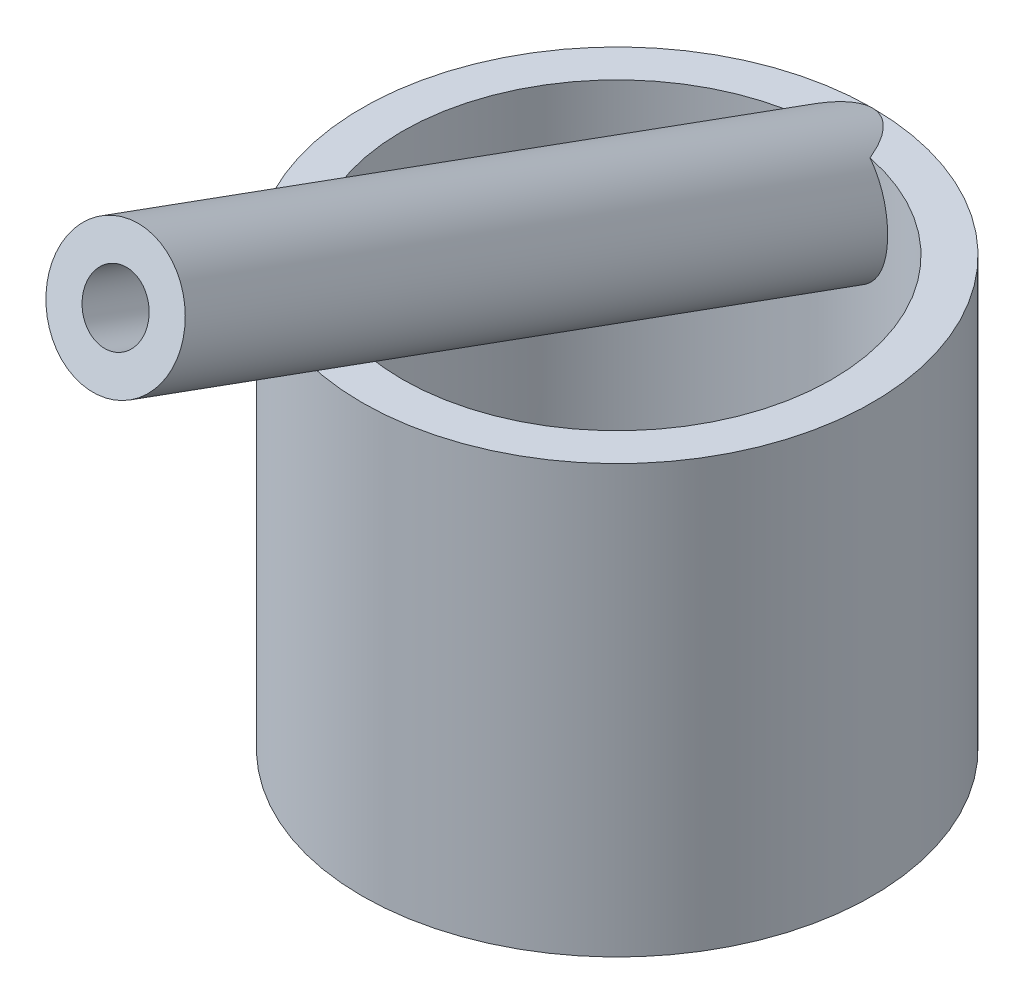
ISO-10303-21;
HEADER;
FILE_DESCRIPTION(('STEP AP214'),'2;1');
FILE_NAME('part.step','',(''),(''),'','','');
FILE_SCHEMA(('AUTOMOTIVE_DESIGN { 1 0 10303 214 1 1 1 1 }'));
ENDSEC;
DATA;
#1=APPLICATION_CONTEXT('core data for automotive mechanical design processes');
#2=APPLICATION_PROTOCOL_DEFINITION('international standard','automotive_design',2000,#1);
#3=PRODUCT_CONTEXT('',#1,'mechanical');
#4=PRODUCT('Part','Part','',(#3));
#5=PRODUCT_RELATED_PRODUCT_CATEGORY('part','',(#4));
#6=PRODUCT_DEFINITION_FORMATION('','',#4);
#7=PRODUCT_DEFINITION_CONTEXT('part definition',#1,'design');
#8=PRODUCT_DEFINITION('design','',#6,#7);
#9=PRODUCT_DEFINITION_SHAPE('','',#8);
#10=(LENGTH_UNIT() NAMED_UNIT(*) SI_UNIT(.MILLI.,.METRE.));
#11=(NAMED_UNIT(*) PLANE_ANGLE_UNIT() SI_UNIT($,.RADIAN.));
#12=(NAMED_UNIT(*) SI_UNIT($,.STERADIAN.) SOLID_ANGLE_UNIT());
#13=UNCERTAINTY_MEASURE_WITH_UNIT(LENGTH_MEASURE(1.E-05),#10,'distance_accuracy_value','');
#14=(GEOMETRIC_REPRESENTATION_CONTEXT(3) GLOBAL_UNCERTAINTY_ASSIGNED_CONTEXT((#13)) GLOBAL_UNIT_ASSIGNED_CONTEXT((#10,
#11,#12)) REPRESENTATION_CONTEXT('',''));
#15=CARTESIAN_POINT('',(0.,0.,0.));
#16=DIRECTION('',(0.,0.,1.));
#17=DIRECTION('',(1.,0.,0.));
#18=AXIS2_PLACEMENT_3D('',#15,#16,#17);
#19=CARTESIAN_POINT('',(0.,22.225,0.));
#20=DIRECTION('',(0.,1.,0.));
#21=DIRECTION('',(0.,0.,1.));
#22=AXIS2_PLACEMENT_3D('',#19,#20,#21);
#23=PLANE('',#22);
#24=CARTESIAN_POINT('',(0.,22.225,-3.24577471184073));
#25=DIRECTION('',(0.,1.,0.));
#26=DIRECTION('',(0.,0.,-1.));
#27=AXIS2_PLACEMENT_3D('',#24,#25,#26);
#28=ELLIPSE('',#27,10.0257252881593,3.429);
#29=CARTESIAN_POINT('',(0.,22.225,-13.2715));
#30=VERTEX_POINT('',#29);
#31=CARTESIAN_POINT('',(-2.19047038879022,22.225,-10.9592342559064));
#32=VERTEX_POINT('',#31);
#33=EDGE_CURVE('E53',#30,#32,#28,.T.);
#34=ORIENTED_EDGE('',*,*,#33,.F.);
#35=CARTESIAN_POINT('',(0.,22.225,0.));
#36=DIRECTION('',(0.,1.,0.));
#37=DIRECTION('',(0.,0.,1.));
#38=AXIS2_PLACEMENT_3D('',#35,#36,#37);
#39=CIRCLE('',#38,13.2715);
#40=EDGE_CURVE('E79',#30,#30,#39,.T.);
#41=ORIENTED_EDGE('',*,*,#40,.T.);
#42=CARTESIAN_POINT('',(2.19047038879022,22.225,-10.9592342559064));
#43=VERTEX_POINT('',#42);
#44=EDGE_CURVE('E91',#43,#30,#28,.T.);
#45=ORIENTED_EDGE('',*,*,#44,.F.);
#46=CARTESIAN_POINT('',(0.,22.225,0.));
#47=DIRECTION('',(0.,1.,0.));
#48=DIRECTION('',(0.,0.,1.));
#49=AXIS2_PLACEMENT_3D('',#46,#47,#48);
#50=CIRCLE('',#49,11.176);
#51=EDGE_CURVE('E71',#32,#43,#50,.T.);
#52=ORIENTED_EDGE('',*,*,#51,.F.);
#53=EDGE_LOOP('',(#34,#41,#45,#52));
#54=FACE_BOUND('',#53,.T.);
#55=ADVANCED_FACE('F33',(#54),#23,.T.);
#56=CARTESIAN_POINT('',(0.,0.,0.));
#57=DIRECTION('',(0.,1.,0.));
#58=DIRECTION('',(0.,0.,1.));
#59=AXIS2_PLACEMENT_3D('',#56,#57,#58);
#60=PLANE('',#59);
#61=CARTESIAN_POINT('',(0.,0.,0.));
#62=DIRECTION('',(0.,1.,0.));
#63=DIRECTION('',(0.,0.,1.));
#64=AXIS2_PLACEMENT_3D('',#61,#62,#63);
#65=CIRCLE('',#64,13.2715);
#66=CARTESIAN_POINT('',(0.,0.,13.2715));
#67=VERTEX_POINT('',#66);
#68=EDGE_CURVE('E94',#67,#67,#65,.T.);
#69=ORIENTED_EDGE('',*,*,#68,.F.);
#70=EDGE_LOOP('',(#69));
#71=FACE_BOUND('',#70,.T.);
#72=CARTESIAN_POINT('',(0.,0.,0.));
#73=DIRECTION('',(0.,1.,0.));
#74=DIRECTION('',(0.,0.,1.));
#75=AXIS2_PLACEMENT_3D('',#72,#73,#74);
#76=CIRCLE('',#75,11.176);
#77=CARTESIAN_POINT('',(0.,0.,11.176));
#78=VERTEX_POINT('',#77);
#79=EDGE_CURVE('E95',#78,#78,#76,.T.);
#80=ORIENTED_EDGE('',*,*,#79,.T.);
#81=EDGE_LOOP('',(#80));
#82=FACE_BOUND('',#81,.T.);
#83=ADVANCED_FACE('F128',(#71,#82),#60,.F.);
#84=CARTESIAN_POINT('',(0.,22.225,0.));
#85=DIRECTION('',(0.,-1.,0.));
#86=DIRECTION('',(0.,0.,-1.));
#87=AXIS2_PLACEMENT_3D('',#84,#85,#86);
#88=CYLINDRICAL_SURFACE('',#87,13.2715);
#89=ORIENTED_EDGE('',*,*,#40,.F.);
#90=EDGE_LOOP('',(#89));
#91=FACE_BOUND('',#90,.T.);
#92=ORIENTED_EDGE('',*,*,#68,.T.);
#93=EDGE_LOOP('',(#92));
#94=FACE_BOUND('',#93,.T.);
#95=ADVANCED_FACE('F35',(#91,#94),#88,.T.);
#96=CARTESIAN_POINT('',(0.,22.225,0.));
#97=DIRECTION('',(0.,-1.,0.));
#98=DIRECTION('',(0.,0.,-1.));
#99=AXIS2_PLACEMENT_3D('',#96,#97,#98);
#100=CYLINDRICAL_SURFACE('',#99,11.176);
#101=CARTESIAN_POINT('',(-2.19047038879022,22.225,-10.9592342559064));
#102=CARTESIAN_POINT('',(-2.26291734310602,22.1662737764277,-10.9447567364857));
#103=CARTESIAN_POINT('',(-2.33282846435218,22.1044789699496,-10.9300333831418));
#104=CARTESIAN_POINT('',(-2.46712386870261,21.9751696265158,-10.9005039812862));
#105=CARTESIAN_POINT('',(-2.53150819558105,21.9076551348704,-10.8856979334306));
#106=CARTESIAN_POINT('',(-2.65420171856522,21.7674306671235,-10.8564343602544));
#107=CARTESIAN_POINT('',(-2.71252009241968,21.6947288289637,-10.8419763346253));
#108=CARTESIAN_POINT('',(-2.82280625962766,21.5445319791795,-10.8137865515093));
#109=CARTESIAN_POINT('',(-2.87477428913047,21.4670371459531,-10.8000547670264));
#110=CARTESIAN_POINT('',(-2.97206940247145,21.3077336747692,-10.7736867455795));
#111=CARTESIAN_POINT('',(-3.0173923281048,21.2259223789333,-10.7610511965916));
#112=CARTESIAN_POINT('',(-3.10111934673299,21.0586207329394,-10.737221266097));
#113=CARTESIAN_POINT('',(-3.13952089005443,20.9731290413195,-10.7260274161097));
#114=CARTESIAN_POINT('',(-3.24399468412244,20.7121676380156,-10.6950843901591));
#115=CARTESIAN_POINT('',(-3.29946366867383,20.5320014217464,-10.6779378257474));
#116=CARTESIAN_POINT('',(-3.38173066924654,20.1636936912497,-10.6521710899908));
#117=CARTESIAN_POINT('',(-3.40835891496463,19.9755116578854,-10.6436014285532));
#118=CARTESIAN_POINT('',(-3.43321281864725,19.597071263319,-10.6356090878275));
#119=CARTESIAN_POINT('',(-3.43142618018978,19.4068120388128,-10.6361903685702));
#120=CARTESIAN_POINT('',(-3.39984309278183,19.0158465394061,-10.6463298204406));
#121=CARTESIAN_POINT('',(-3.36814490315228,18.8153125950927,-10.6564974418587));
#122=CARTESIAN_POINT('',(-3.27603178991239,18.4214979515156,-10.6851711904645));
#123=CARTESIAN_POINT('',(-3.21559311424036,18.2282233944526,-10.7036842139011));
#124=CARTESIAN_POINT('',(-3.06006783402356,17.8331756702481,-10.7492421779956));
#125=CARTESIAN_POINT('',(-2.96200286442946,17.6326507738797,-10.7769802739856));
#126=CARTESIAN_POINT('',(-2.73520320509379,17.2507257376851,-10.8367595026731));
#127=CARTESIAN_POINT('',(-2.60650179900822,17.0693051491873,-10.8687959492418));
#128=CARTESIAN_POINT('',(-2.33986237830492,16.7543727490455,-10.9290436006889));
#129=CARTESIAN_POINT('',(-2.2056489952018,16.6177044511539,-10.9571727000357));
#130=CARTESIAN_POINT('',(-1.91685881764607,16.3667869040481,-11.0113692042399));
#131=CARTESIAN_POINT('',(-1.76223657572916,16.2525891501415,-11.0374317936232));
#132=CARTESIAN_POINT('',(-1.59831016845887,16.1520314764767,-11.061120223802));
#133=B_SPLINE_CURVE_WITH_KNOTS('',3,(#101,#102,#103,#104,#105,#106,#107,#108,#109,#110,#111,
#112,#113,#114,#115,#116,#117,#118,#119,#120,#121,#122,#123,#124,#125,#126,#127,#128,#129,#130,
#131,#132),.UNSPECIFIED.,.F.,.F.,(4,2,2,2,2,2,2,2,2,2,2,2,2,2,2,4),(0.,0.283047512814927,
0.566092783586369,0.848703381121747,1.13130346605949,1.41407964141967,1.69695977286953,
2.26198405540798,2.83031655991647,3.39889501462335,4.00624604947015,4.61409989337594,
5.28596317671785,5.95709984747419,6.53563480392207,7.11548051930881),.UNSPECIFIED.);
#134=CARTESIAN_POINT('',(-1.59831016845882,16.1520314764767,-11.061120223802));
#135=VERTEX_POINT('',#134);
#136=EDGE_CURVE('E11',#32,#135,#133,.T.);
#137=ORIENTED_EDGE('',*,*,#136,.F.);
#138=ORIENTED_EDGE('',*,*,#51,.T.);
#139=CARTESIAN_POINT('',(1.59831016845887,16.1520314764767,-11.061120223802));
#140=CARTESIAN_POINT('',(1.77962429484729,16.2632695780732,-11.0349135218428));
#141=CARTESIAN_POINT('',(1.94952182900196,16.3911482974039,-11.0058167618451));
#142=CARTESIAN_POINT('',(2.26385921081734,16.6736335281687,-10.9454776009937));
#143=CARTESIAN_POINT('',(2.40839742012345,16.8281319465816,-10.9142441742013));
#144=CARTESIAN_POINT('',(2.67041597161385,17.1577201673717,-10.853106572441));
#145=CARTESIAN_POINT('',(2.78798663257848,17.3327381789397,-10.8231982393796));
#146=CARTESIAN_POINT('',(2.99546871390946,17.6994196045999,-10.7676226873833));
#147=CARTESIAN_POINT('',(3.08533846353401,17.891107545438,-10.7419618846346));
#148=CARTESIAN_POINT('',(3.24227864714567,18.3046626878367,-10.695697123604));
#149=CARTESIAN_POINT('',(3.30651755176497,18.527687303032,-10.6757689608289));
#150=CARTESIAN_POINT('',(3.39669674755438,18.9822306004665,-10.6474301882781));
#151=CARTESIAN_POINT('',(3.4226557212384,19.2137450826459,-10.63901396025));
#152=CARTESIAN_POINT('',(3.43053826473217,19.5571669589951,-10.6364609889659));
#153=CARTESIAN_POINT('',(3.42831494960707,19.6688523788801,-10.6371830915082));
#154=CARTESIAN_POINT('',(3.41404903430869,19.8915139120453,-10.6417726885809));
#155=CARTESIAN_POINT('',(3.40201134203061,20.0024903519174,-10.6456386109725));
#156=CARTESIAN_POINT('',(3.36792728962074,20.2227013674966,-10.6564700857836));
#157=CARTESIAN_POINT('',(3.3458844211514,20.3319365371272,-10.6634345568375));
#158=CARTESIAN_POINT('',(3.29171790920363,20.5476460846103,-10.6802797241361));
#159=CARTESIAN_POINT('',(3.25959563065969,20.6541208341613,-10.6901600255138));
#160=CARTESIAN_POINT('',(3.18931939267111,20.8520406104055,-10.7113216401886));
#161=CARTESIAN_POINT('',(3.15217848069356,20.94387485435,-10.7223399556995));
#162=CARTESIAN_POINT('',(3.07007603056299,21.123736810663,-10.7461358356154));
#163=CARTESIAN_POINT('',(3.02511518293815,21.211764858276,-10.7589132446654));
#164=CARTESIAN_POINT('',(2.92766099249447,21.383248071201,-10.7858392442833));
#165=CARTESIAN_POINT('',(2.87517269063261,21.4667062455732,-10.7999869151773));
#166=CARTESIAN_POINT('',(2.76301518962202,21.628429110005,-10.8292234594333));
#167=CARTESIAN_POINT('',(2.70334841473834,21.7066955396099,-10.8443120142218));
#168=CARTESIAN_POINT('',(2.57261580141727,21.863011415147,-10.8760960605336));
#169=CARTESIAN_POINT('',(2.50103468462739,21.9406230678962,-10.8928282002494));
#170=CARTESIAN_POINT('',(2.35086278772376,22.0884556999518,-10.9262229902329));
#171=CARTESIAN_POINT('',(2.27228525252811,22.1586901176766,-10.9428857118233));
#172=CARTESIAN_POINT('',(2.19047038879022,22.225,-10.9592342559064));
#173=B_SPLINE_CURVE_WITH_KNOTS('',3,(#139,#140,#141,#142,#143,#144,#145,#146,#147,#148,#149,
#150,#151,#152,#153,#154,#155,#156,#157,#158,#159,#160,#161,#162,#163,#164,#165,#166,#167,#168,
#169,#170,#171,#172),.UNSPECIFIED.,.F.,.F.,(4,2,2,2,2,2,2,2,2,2,2,2,2,2,2,2,4),(0.,
0.641070470994365,1.27959662696867,1.91595196802881,2.55325996442385,3.24876759746485,
3.94393567564916,4.27867425227303,4.61324553810529,4.94770015304193,5.282109496304,
5.58073989939126,5.87934394572549,6.17774894979668,6.476053459958,6.79625865509036,
7.11587005971322),.UNSPECIFIED.);
#174=CARTESIAN_POINT('',(1.59831016845882,16.1520314764767,-11.061120223802));
#175=VERTEX_POINT('',#174);
#176=EDGE_CURVE('E46',#175,#43,#173,.T.);
#177=ORIENTED_EDGE('',*,*,#176,.F.);
#178=CARTESIAN_POINT('',(0.,-14.2381465722923,0.));
#179=DIRECTION('',(0.,-0.342020143325666,-0.939692620785909));
#180=DIRECTION('',(0.,-0.93969262078591,0.342020143325666));
#181=AXIS2_PLACEMENT_3D('',#178,#179,#180);
#182=ELLIPSE('',#181,32.6764379762229,11.176);
#183=EDGE_CURVE('E60',#135,#175,#182,.T.);
#184=ORIENTED_EDGE('',*,*,#183,.F.);
#185=EDGE_LOOP('',(#137,#138,#177,#184));
#186=FACE_BOUND('',#185,.T.);
#187=ORIENTED_EDGE('',*,*,#79,.F.);
#188=EDGE_LOOP('',(#187));
#189=FACE_BOUND('',#188,.T.);
#190=ADVANCED_FACE('F69',(#186,#189),#100,.F.);
#191=CARTESIAN_POINT('',(0.,19.0027940033251,-12.0987129285363));
#192=DIRECTION('',(0.,-0.342020143325666,-0.939692620785909));
#193=DIRECTION('',(0.,0.93969262078591,-0.342020143325666));
#194=AXIS2_PLACEMENT_3D('',#191,#192,#193);
#195=PLANE('',#194);
#196=CARTESIAN_POINT('',(0.,19.0027940033251,-12.0987129285363));
#197=DIRECTION('',(0.,-0.342020143325666,-0.939692620785909));
#198=DIRECTION('',(0.,0.93969262078591,-0.342020143325666));
#199=AXIS2_PLACEMENT_3D('',#196,#197,#198);
#200=CIRCLE('',#199,3.429);
#201=EDGE_CURVE('E78',#175,#135,#200,.T.);
#202=ORIENTED_EDGE('',*,*,#201,.T.);
#203=ORIENTED_EDGE('',*,*,#183,.T.);
#204=EDGE_LOOP('',(#202,#203));
#205=FACE_BOUND('',#204,.T.);
#206=ADVANCED_FACE('F77',(#205),#195,.T.);
#207=CARTESIAN_POINT('',(0.,32.9024926280802,26.0903951802031));
#208=DIRECTION('',(0.,-0.342020143325666,-0.939692620785909));
#209=DIRECTION('',(0.,0.93969262078591,-0.342020143325666));
#210=AXIS2_PLACEMENT_3D('',#207,#208,#209);
#211=CYLINDRICAL_SURFACE('',#210,3.429);
#212=CARTESIAN_POINT('',(0.,32.9024926280802,26.0903951802031));
#213=DIRECTION('',(0.,-0.342020143325666,-0.939692620785909));
#214=DIRECTION('',(0.,0.93969262078591,-0.342020143325666));
#215=AXIS2_PLACEMENT_3D('',#212,#213,#214);
#216=CIRCLE('',#215,3.429);
#217=CARTESIAN_POINT('',(0.,36.1246986247551,24.9176081087394));
#218=VERTEX_POINT('',#217);
#219=EDGE_CURVE('E82',#218,#218,#216,.T.);
#220=ORIENTED_EDGE('',*,*,#219,.T.);
#221=EDGE_LOOP('',(#220));
#222=FACE_BOUND('',#221,.T.);
#223=ORIENTED_EDGE('',*,*,#33,.T.);
#224=ORIENTED_EDGE('',*,*,#136,.T.);
#225=ORIENTED_EDGE('',*,*,#201,.F.);
#226=ORIENTED_EDGE('',*,*,#176,.T.);
#227=ORIENTED_EDGE('',*,*,#44,.T.);
#228=EDGE_LOOP('',(#223,#224,#225,#226,#227));
#229=FACE_BOUND('',#228,.T.);
#230=ADVANCED_FACE('F81',(#222,#229),#211,.T.);
#231=CARTESIAN_POINT('',(0.,32.9024926280802,26.0903951802031));
#232=DIRECTION('',(0.,-0.342020143325666,-0.939692620785909));
#233=DIRECTION('',(0.,0.93969262078591,-0.342020143325666));
#234=AXIS2_PLACEMENT_3D('',#231,#232,#233);
#235=PLANE('',#234);
#236=CARTESIAN_POINT('',(0.,32.9024926280802,26.0903951802031));
#237=DIRECTION('',(0.,-0.342020143325666,-0.939692620785909));
#238=DIRECTION('',(0.,0.93969262078591,-0.342020143325666));
#239=AXIS2_PLACEMENT_3D('',#236,#237,#238);
#240=CIRCLE('',#239,1.651);
#241=CARTESIAN_POINT('',(0.,34.4539251449977,25.5257199235724));
#242=VERTEX_POINT('',#241);
#243=EDGE_CURVE('E83',#242,#242,#240,.T.);
#244=ORIENTED_EDGE('',*,*,#243,.T.);
#245=EDGE_LOOP('',(#244));
#246=FACE_BOUND('',#245,.T.);
#247=ORIENTED_EDGE('',*,*,#219,.F.);
#248=EDGE_LOOP('',(#247));
#249=FACE_BOUND('',#248,.T.);
#250=ADVANCED_FACE('F112',(#246,#249),#235,.F.);
#251=CARTESIAN_POINT('',(0.,32.9024926280802,26.0903951802031));
#252=DIRECTION('',(0.,-0.342020143325666,-0.939692620785909));
#253=DIRECTION('',(0.,0.93969262078591,-0.342020143325666));
#254=AXIS2_PLACEMENT_3D('',#251,#252,#253);
#255=CYLINDRICAL_SURFACE('',#254,1.651);
#256=CARTESIAN_POINT('',(0.,21.0955915464427,-11.176));
#257=CARTESIAN_POINT('',(-0.0910225608203051,21.095587845338,-11.1759985072696));
#258=CARTESIAN_POINT('',(-0.182104488960318,21.0879614370336,-11.1748763007973));
#259=CARTESIAN_POINT('',(-0.361741104790183,21.0576419448226,-11.1705065784069));
#260=CARTESIAN_POINT('',(-0.450292962239255,21.0349326277325,-11.1672567726855));
#261=CARTESIAN_POINT('',(-0.622240156723919,20.9750907716588,-11.1589963099463));
#262=CARTESIAN_POINT('',(-0.705638563747641,20.9379669175448,-11.153986713389));
#263=CARTESIAN_POINT('',(-0.864974312325789,20.8503621508504,-11.1427637043222));
#264=CARTESIAN_POINT('',(-0.940913412283726,20.7998843966347,-11.1365505765559));
#265=CARTESIAN_POINT('',(-1.08360620587709,20.6867821359394,-11.123575759393));
#266=CARTESIAN_POINT('',(-1.15031917786211,20.6241065457501,-11.1168118351097));
#267=CARTESIAN_POINT('',(-1.27246815143041,20.4885801710899,-11.1034943188094));
#268=CARTESIAN_POINT('',(-1.3279032789241,20.4157285986668,-11.0969407431287));
#269=CARTESIAN_POINT('',(-1.42712397974633,20.260561669286,-11.0846220952198));
#270=CARTESIAN_POINT('',(-1.47068138754664,20.1780993112765,-11.0788733778976));
#271=CARTESIAN_POINT('',(-1.54398696566375,20.0071752159869,-11.0688957814272));
#272=CARTESIAN_POINT('',(-1.57373289013322,19.9187125056843,-11.0646671494811));
#273=CARTESIAN_POINT('',(-1.61995367002218,19.734657185853,-11.0579970534913));
#274=CARTESIAN_POINT('',(-1.63586670850657,19.6389210771159,-11.0556315851941));
#275=CARTESIAN_POINT('',(-1.65247744319265,19.4461149334244,-11.0531607098426));
#276=CARTESIAN_POINT('',(-1.6531709681498,19.3490445400736,-11.0530559223781));
#277=CARTESIAN_POINT('',(-1.63932980178857,19.150566895804,-11.055117750362));
#278=CARTESIAN_POINT('',(-1.62394227074972,19.0492202923179,-11.0574115774555));
#279=CARTESIAN_POINT('',(-1.57725996520241,18.8503193992313,-11.0641663102193));
#280=CARTESIAN_POINT('',(-1.54595996084146,18.7527663677948,-11.0686279283424));
#281=CARTESIAN_POINT('',(-1.46654339471622,18.5599049278735,-11.0794358755623));
#282=CARTESIAN_POINT('',(-1.41776187925678,18.4648731995376,-11.0858549674585));
#283=CARTESIAN_POINT('',(-1.30471543313087,18.2845418761534,-11.0997264150937));
#284=CARTESIAN_POINT('',(-1.24044858747816,18.1992434866979,-11.1071788985782));
#285=CARTESIAN_POINT('',(-1.09892134395399,18.0427922104369,-11.1220643216438));
#286=CARTESIAN_POINT('',(-1.02190122076608,17.9714229007249,-11.1294954271882));
#287=CARTESIAN_POINT('',(-0.855875341412696,17.8441988963361,-11.1434895374259));
#288=CARTESIAN_POINT('',(-0.766878512971907,17.7883327393208,-11.1500531815908));
#289=CARTESIAN_POINT('',(-0.58813229868341,17.699460584034,-11.1608393382891));
#290=CARTESIAN_POINT('',(-0.499204839078977,17.6648247271425,-11.165221641973));
#291=CARTESIAN_POINT('',(-0.31637430512891,17.6128187587225,-11.1718939892862));
#292=CARTESIAN_POINT('',(-0.222475525538201,17.5954339921988,-11.1741858086713));
#293=CARTESIAN_POINT('',(-0.0428527811998692,17.579839044479,-11.1762413927035));
#294=CARTESIAN_POINT('',(0.0427169594377254,17.579838235165,-11.1762412437323));
#295=CARTESIAN_POINT('',(0.212544807614251,17.5945608489182,-11.1743011530972));
#296=CARTESIAN_POINT('',(0.296803144027978,17.6092816727306,-11.1723615538631));
#297=CARTESIAN_POINT('',(0.459126646850118,17.6520443702341,-11.1668523800541));
#298=CARTESIAN_POINT('',(0.537300999400093,17.6796826058577,-11.1633323141526));
#299=CARTESIAN_POINT('',(0.688244685070827,17.7469005672191,-11.1550444588089));
#300=CARTESIAN_POINT('',(0.761012967791366,17.7864826061167,-11.1502764276965));
#301=CARTESIAN_POINT('',(0.903829811925627,17.8787920974315,-11.139636546358));
#302=CARTESIAN_POINT('',(0.973458112644736,17.9321621785347,-11.1337158603337));
#303=CARTESIAN_POINT('',(1.10378814674407,18.0488255720735,-11.1215520999911));
#304=CARTESIAN_POINT('',(1.1644862019143,18.1121229513347,-11.1153088942552));
#305=CARTESIAN_POINT('',(1.28180232664983,18.2538064859778,-11.1024230106866));
#306=CARTESIAN_POINT('',(1.33735804612871,18.3330750358689,-11.095805323377));
#307=CARTESIAN_POINT('',(1.43562106172891,18.4992846265358,-11.0835204299367));
#308=CARTESIAN_POINT('',(1.47832267669655,18.5862290379362,-11.0778536445663));
#309=CARTESIAN_POINT('',(1.55312449490622,18.7731544292346,-11.0676254161164));
#310=CARTESIAN_POINT('',(1.58404289955331,18.8736178599009,-11.0631956468151));
#311=CARTESIAN_POINT('',(1.62907467702133,19.078335565523,-11.0566547017001));
#312=CARTESIAN_POINT('',(1.64318496725946,19.1825905322289,-11.0545439511964));
#313=CARTESIAN_POINT('',(1.65399380494639,19.3938505637872,-11.0529325302521));
#314=CARTESIAN_POINT('',(1.65038886946212,19.5008720956325,-11.0534773516364));
#315=CARTESIAN_POINT('',(1.62461385515562,19.7126189158903,-11.057295162477));
#316=CARTESIAN_POINT('',(1.60244855675286,19.8173447884478,-11.0605674494443));
#317=CARTESIAN_POINT('',(1.5409985281072,20.0165772554043,-11.0692912783909));
#318=CARTESIAN_POINT('',(1.50250000057543,20.1113301955173,-11.0746418870436));
#319=CARTESIAN_POINT('',(1.40927082959544,20.2923738721601,-11.0868899799145));
#320=CARTESIAN_POINT('',(1.35454647178635,20.378667868363,-11.0937868648771));
#321=CARTESIAN_POINT('',(1.23383791279518,20.535156517711,-11.1078388580486));
#322=CARTESIAN_POINT('',(1.16867566588275,20.6059893010354,-11.1149566995908));
#323=CARTESIAN_POINT('',(1.02692552674239,20.7351835910833,-11.1289467214954));
#324=CARTESIAN_POINT('',(0.95033743187734,20.7935448765805,-11.1358188974982));
#325=CARTESIAN_POINT('',(0.790948059349764,20.8940566911688,-11.1482524883709));
#326=CARTESIAN_POINT('',(0.708468405655013,20.9367138293909,-11.1538520930881));
#327=CARTESIAN_POINT('',(0.537441159892936,21.007379724869,-11.1633971423016));
#328=CARTESIAN_POINT('',(0.448900996567096,21.0354060647843,-11.1673445711743));
#329=CARTESIAN_POINT('',(0.299865027592718,21.068968824774,-11.1721321848335));
#330=CARTESIAN_POINT('',(0.240348693877404,21.0789390784761,-11.1735758150812));
#331=CARTESIAN_POINT('',(0.120563586685838,21.0922516423392,-11.17551021379));
#332=CARTESIAN_POINT('',(0.0602948183908357,21.0955939981143,-11.1760009888088));
#333=CARTESIAN_POINT('',(0.,21.0955915464427,-11.176));
#334=B_SPLINE_CURVE_WITH_KNOTS('',3,(#256,#257,#258,#259,#260,#261,#262,#263,#264,#265,#266,
#267,#268,#269,#270,#271,#272,#273,#274,#275,#276,#277,#278,#279,#280,#281,#282,#283,#284,#285,
#286,#287,#288,#289,#290,#291,#292,#293,#294,#295,#296,#297,#298,#299,#300,#301,#302,#303,#304,
#305,#306,#307,#308,#309,#310,#311,#312,#313,#314,#315,#316,#317,#318,#319,#320,#321,#322,#323,
#324,#325,#326,#327,#328,#329,#330,#331,#332,#333),.UNSPECIFIED.,.T.,.F.,(4,2,2,2,2,2,2,2,2,2,2,
2,2,2,2,2,2,2,2,2,2,2,2,2,2,2,2,2,2,2,2,2,2,2,2,2,2,2,4),(0.,0.272847281727863,
0.545988695903261,0.818965794999284,1.09187838922009,1.36595952184315,1.64006188904435,
1.91910839372504,2.19820025751381,2.48815883153417,2.77819687412748,3.08443696338767,
3.39077776778287,3.71028505533214,4.02983187490011,4.34392932514804,4.65779392326363,
4.94279357543183,5.2275509093917,5.4829767621025,5.73835752472649,5.98624314273592,
6.23417679967141,6.49688035362929,6.75969180941953,7.04954376751858,7.33952364459533,
7.65369810424969,7.96793017415864,8.28756399059898,8.60711550725314,8.91277382845845,
9.2183138966509,9.50639727369038,9.79448576048886,10.0722352357077,10.3496501507554,
10.5303898527971,10.7111283109546),.UNSPECIFIED.);
#335=CARTESIAN_POINT('',(0.,21.0955915464427,-11.176));
#336=VERTEX_POINT('',#335);
#337=EDGE_CURVE('E86',#336,#336,#334,.T.);
#338=ORIENTED_EDGE('',*,*,#337,.F.);
#339=EDGE_LOOP('',(#338));
#340=FACE_BOUND('',#339,.T.);
#341=ORIENTED_EDGE('',*,*,#243,.F.);
#342=EDGE_LOOP('',(#341));
#343=FACE_BOUND('',#342,.T.);
#344=ADVANCED_FACE('F107',(#340,#343),#255,.F.);
#345=ORIENTED_EDGE('',*,*,#337,.T.);
#346=EDGE_LOOP('',(#345));
#347=FACE_BOUND('',#346,.T.);
#348=ADVANCED_FACE('F111',(#347),#100,.F.);
#349=CLOSED_SHELL('',(#55,#83,#95,#190,#206,#230,#250,#344,#348));
#350=MANIFOLD_SOLID_BREP('B2',#349);
#351=ADVANCED_BREP_SHAPE_REPRESENTATION('',(#18,#350),#14);
#352=SHAPE_DEFINITION_REPRESENTATION(#9,#351);
ENDSEC;
END-ISO-10303-21;
